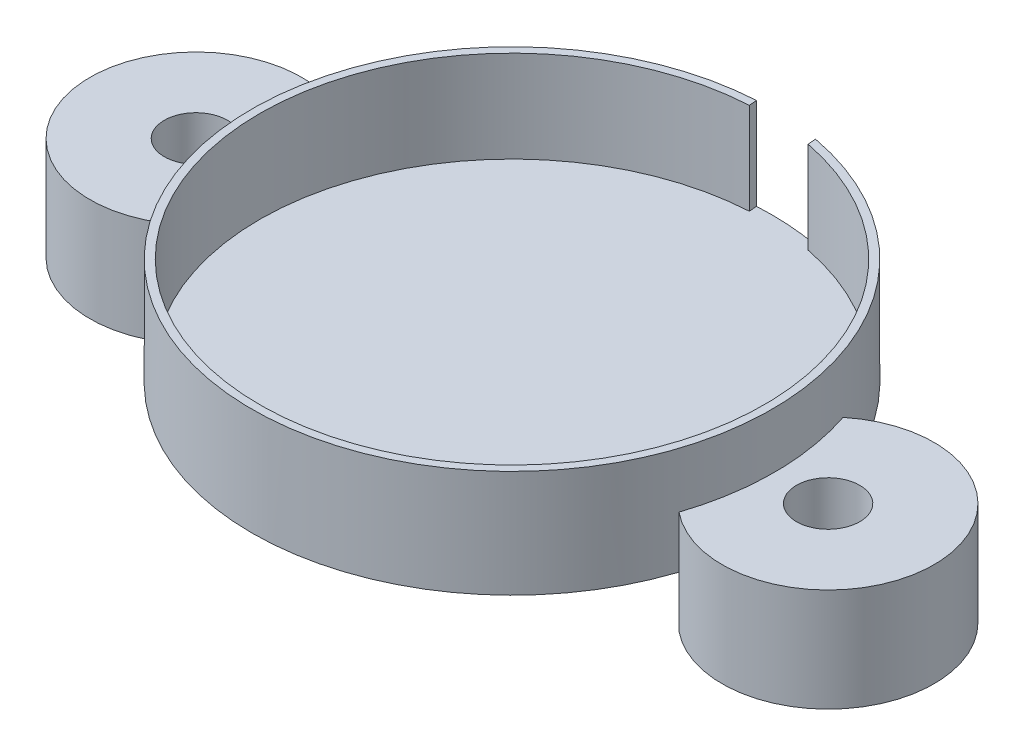
ISO-10303-21;
HEADER;
FILE_DESCRIPTION(('STEP AP214'),'2;1');
FILE_NAME('part.step','',(''),(''),'','','');
FILE_SCHEMA(('AUTOMOTIVE_DESIGN { 1 0 10303 214 1 1 1 1 }'));
ENDSEC;
DATA;
#1=APPLICATION_CONTEXT('core data for automotive mechanical design processes');
#2=APPLICATION_PROTOCOL_DEFINITION('international standard','automotive_design',2000,#1);
#3=PRODUCT_CONTEXT('',#1,'mechanical');
#4=PRODUCT('Part','Part','',(#3));
#5=PRODUCT_RELATED_PRODUCT_CATEGORY('part','',(#4));
#6=PRODUCT_DEFINITION_FORMATION('','',#4);
#7=PRODUCT_DEFINITION_CONTEXT('part definition',#1,'design');
#8=PRODUCT_DEFINITION('design','',#6,#7);
#9=PRODUCT_DEFINITION_SHAPE('','',#8);
#10=(LENGTH_UNIT() NAMED_UNIT(*) SI_UNIT(.MILLI.,.METRE.));
#11=(NAMED_UNIT(*) PLANE_ANGLE_UNIT() SI_UNIT($,.RADIAN.));
#12=(NAMED_UNIT(*) SI_UNIT($,.STERADIAN.) SOLID_ANGLE_UNIT());
#13=UNCERTAINTY_MEASURE_WITH_UNIT(LENGTH_MEASURE(1.E-05),#10,'distance_accuracy_value','');
#14=(GEOMETRIC_REPRESENTATION_CONTEXT(3) GLOBAL_UNCERTAINTY_ASSIGNED_CONTEXT((#13)) GLOBAL_UNIT_ASSIGNED_CONTEXT((#10,
#11,#12)) REPRESENTATION_CONTEXT('',''));
#15=CARTESIAN_POINT('',(0.,0.,0.));
#16=DIRECTION('',(0.,0.,1.));
#17=DIRECTION('',(1.,0.,0.));
#18=AXIS2_PLACEMENT_3D('',#15,#16,#17);
#19=CARTESIAN_POINT('',(-32.6182191368439,-10.16,0.));
#20=DIRECTION('',(0.,1.,0.));
#21=DIRECTION('',(0.,0.,1.));
#22=AXIS2_PLACEMENT_3D('',#19,#20,#21);
#23=PLANE('',#22);
#24=CARTESIAN_POINT('',(-0.46643827368778,-10.16,0.));
#25=DIRECTION('',(0.,1.,0.));
#26=DIRECTION('',(0.,0.,1.));
#27=AXIS2_PLACEMENT_3D('',#24,#25,#26);
#28=CIRCLE('',#27,53.276500000001);
#29=CARTESIAN_POINT('',(-51.0212227941176,-10.16,-16.8106875035797));
#30=VERTEX_POINT('',#29);
#31=CARTESIAN_POINT('',(-51.0212227941177,-10.16,16.8106875035797));
#32=VERTEX_POINT('',#31);
#33=EDGE_CURVE('E89',#30,#32,#28,.T.);
#34=ORIENTED_EDGE('',*,*,#33,.T.);
#35=CARTESIAN_POINT('',(-64.77,-10.16,0.));
#36=DIRECTION('',(0.,-1.,0.));
#37=DIRECTION('',(0.,0.,-1.));
#38=AXIS2_PLACEMENT_3D('',#35,#36,#37);
#39=CIRCLE('',#38,21.717);
#40=EDGE_CURVE('E64',#32,#30,#39,.T.);
#41=ORIENTED_EDGE('',*,*,#40,.T.);
#42=EDGE_LOOP('',(#34,#41));
#43=FACE_BOUND('',#42,.T.);
#44=CARTESIAN_POINT('',(-64.77,-10.16,0.));
#45=DIRECTION('',(0.,-1.,0.));
#46=DIRECTION('',(0.,0.,-1.));
#47=AXIS2_PLACEMENT_3D('',#44,#45,#46);
#48=CIRCLE('',#47,6.477);
#49=CARTESIAN_POINT('',(-64.77,-10.16,-6.477));
#50=VERTEX_POINT('',#49);
#51=EDGE_CURVE('E86',#50,#50,#48,.T.);
#52=ORIENTED_EDGE('',*,*,#51,.F.);
#53=EDGE_LOOP('',(#52));
#54=FACE_BOUND('',#53,.T.);
#55=ADVANCED_FACE('F50',(#43,#54),#23,.F.);
#56=CARTESIAN_POINT('',(-0.46643827368778,-10.16,0.));
#57=DIRECTION('',(0.,1.,0.));
#58=DIRECTION('',(0.,0.,1.));
#59=AXIS2_PLACEMENT_3D('',#56,#57,#58);
#60=CYLINDRICAL_SURFACE('',#59,53.276500000001);
#61=DIRECTION('',(0.,1.,0.));
#62=VECTOR('',#61,1.);
#63=CARTESIAN_POINT('',(-51.0212227941176,-10.16,-16.8106875035797));
#64=LINE('',#63,#62);
#65=CARTESIAN_POINT('',(-51.0212227941176,10.9855,-16.8106875035797));
#66=VERTEX_POINT('',#65);
#67=EDGE_CURVE('E58',#30,#66,#64,.T.);
#68=ORIENTED_EDGE('',*,*,#67,.T.);
#69=CARTESIAN_POINT('',(-0.46643827368778,10.9855,0.));
#70=DIRECTION('',(0.,1.,0.));
#71=DIRECTION('',(0.,0.,1.));
#72=AXIS2_PLACEMENT_3D('',#69,#70,#71);
#73=CIRCLE('',#72,53.276500000001);
#74=CARTESIAN_POINT('',(-51.0212227941177,10.9855,16.8106875035797));
#75=VERTEX_POINT('',#74);
#76=EDGE_CURVE('E81',#66,#75,#73,.T.);
#77=ORIENTED_EDGE('',*,*,#76,.T.);
#78=DIRECTION('',(0.,1.,0.));
#79=VECTOR('',#78,1.);
#80=CARTESIAN_POINT('',(-51.0212227941177,-10.16,16.8106875035797));
#81=LINE('',#80,#79);
#82=EDGE_CURVE('E12',#32,#75,#81,.T.);
#83=ORIENTED_EDGE('',*,*,#82,.F.);
#84=ORIENTED_EDGE('',*,*,#33,.F.);
#85=EDGE_LOOP('',(#68,#77,#83,#84));
#86=FACE_BOUND('',#85,.T.);
#87=ADVANCED_FACE('F52',(#86),#60,.F.);
#88=CARTESIAN_POINT('',(-64.77,-10.16,0.));
#89=DIRECTION('',(0.,1.,0.));
#90=DIRECTION('',(0.,0.,1.));
#91=AXIS2_PLACEMENT_3D('',#88,#89,#90);
#92=CYLINDRICAL_SURFACE('',#91,21.717);
#93=ORIENTED_EDGE('',*,*,#82,.T.);
#94=CARTESIAN_POINT('',(-64.77,10.9855,0.));
#95=DIRECTION('',(0.,-1.,0.));
#96=DIRECTION('',(0.,0.,-1.));
#97=AXIS2_PLACEMENT_3D('',#94,#95,#96);
#98=CIRCLE('',#97,21.717);
#99=EDGE_CURVE('E77',#75,#66,#98,.T.);
#100=ORIENTED_EDGE('',*,*,#99,.T.);
#101=ORIENTED_EDGE('',*,*,#67,.F.);
#102=ORIENTED_EDGE('',*,*,#40,.F.);
#103=EDGE_LOOP('',(#93,#100,#101,#102));
#104=FACE_BOUND('',#103,.T.);
#105=ADVANCED_FACE('F75',(#104),#92,.T.);
#106=CARTESIAN_POINT('',(-64.77,-10.16,0.));
#107=DIRECTION('',(0.,1.,0.));
#108=DIRECTION('',(0.,0.,1.));
#109=AXIS2_PLACEMENT_3D('',#106,#107,#108);
#110=CYLINDRICAL_SURFACE('',#109,6.477);
#111=ORIENTED_EDGE('',*,*,#51,.T.);
#112=EDGE_LOOP('',(#111));
#113=FACE_BOUND('',#112,.T.);
#114=CARTESIAN_POINT('',(-64.77,10.9855,0.));
#115=DIRECTION('',(0.,-1.,0.));
#116=DIRECTION('',(0.,0.,-1.));
#117=AXIS2_PLACEMENT_3D('',#114,#115,#116);
#118=CIRCLE('',#117,6.477);
#119=CARTESIAN_POINT('',(-64.77,10.9855,-6.477));
#120=VERTEX_POINT('',#119);
#121=EDGE_CURVE('E83',#120,#120,#118,.T.);
#122=ORIENTED_EDGE('',*,*,#121,.F.);
#123=EDGE_LOOP('',(#122));
#124=FACE_BOUND('',#123,.T.);
#125=ADVANCED_FACE('F99',(#113,#124),#110,.F.);
#126=CARTESIAN_POINT('',(-32.6182191368439,10.9855,0.));
#127=DIRECTION('',(0.,1.,0.));
#128=DIRECTION('',(0.,0.,1.));
#129=AXIS2_PLACEMENT_3D('',#126,#127,#128);
#130=PLANE('',#129);
#131=ORIENTED_EDGE('',*,*,#121,.T.);
#132=EDGE_LOOP('',(#131));
#133=FACE_BOUND('',#132,.T.);
#134=ORIENTED_EDGE('',*,*,#76,.F.);
#135=ORIENTED_EDGE('',*,*,#99,.F.);
#136=EDGE_LOOP('',(#134,#135));
#137=FACE_BOUND('',#136,.T.);
#138=ADVANCED_FACE('F85',(#133,#137),#130,.T.);
#139=CLOSED_SHELL('',(#55,#87,#105,#125,#138));
#140=MANIFOLD_SOLID_BREP('B2',#139);
#141=CARTESIAN_POINT('',(32.6182191368444,-10.16,0.));
#142=DIRECTION('',(0.,1.,0.));
#143=DIRECTION('',(0.,0.,1.));
#144=AXIS2_PLACEMENT_3D('',#141,#142,#143);
#145=PLANE('',#144);
#146=CARTESIAN_POINT('',(0.466438273688814,-10.16,0.));
#147=DIRECTION('',(0.,1.,0.));
#148=DIRECTION('',(0.,0.,1.));
#149=AXIS2_PLACEMENT_3D('',#146,#147,#148);
#150=CIRCLE('',#149,53.2765);
#151=CARTESIAN_POINT('',(51.0212227941176,-10.16,16.8106875035797));
#152=VERTEX_POINT('',#151);
#153=CARTESIAN_POINT('',(51.0212227941176,-10.16,-16.8106875035797));
#154=VERTEX_POINT('',#153);
#155=EDGE_CURVE('E197',#152,#154,#150,.T.);
#156=ORIENTED_EDGE('',*,*,#155,.T.);
#157=CARTESIAN_POINT('',(64.77,-10.16,0.));
#158=DIRECTION('',(0.,-1.,0.));
#159=DIRECTION('',(0.,0.,-1.));
#160=AXIS2_PLACEMENT_3D('',#157,#158,#159);
#161=CIRCLE('',#160,21.717);
#162=EDGE_CURVE('E172',#154,#152,#161,.T.);
#163=ORIENTED_EDGE('',*,*,#162,.T.);
#164=EDGE_LOOP('',(#156,#163));
#165=FACE_BOUND('',#164,.T.);
#166=CARTESIAN_POINT('',(64.77,-10.16,0.));
#167=DIRECTION('',(0.,-1.,0.));
#168=DIRECTION('',(0.,0.,-1.));
#169=AXIS2_PLACEMENT_3D('',#166,#167,#168);
#170=CIRCLE('',#169,6.477);
#171=CARTESIAN_POINT('',(64.77,-10.16,-6.477));
#172=VERTEX_POINT('',#171);
#173=EDGE_CURVE('E194',#172,#172,#170,.T.);
#174=ORIENTED_EDGE('',*,*,#173,.F.);
#175=EDGE_LOOP('',(#174));
#176=FACE_BOUND('',#175,.T.);
#177=ADVANCED_FACE('F158',(#165,#176),#145,.F.);
#178=CARTESIAN_POINT('',(0.466438273688814,-10.16,0.));
#179=DIRECTION('',(0.,1.,0.));
#180=DIRECTION('',(0.,0.,1.));
#181=AXIS2_PLACEMENT_3D('',#178,#179,#180);
#182=CYLINDRICAL_SURFACE('',#181,53.2765);
#183=DIRECTION('',(0.,1.,0.));
#184=VECTOR('',#183,1.);
#185=CARTESIAN_POINT('',(51.0212227941176,-10.16,16.8106875035797));
#186=LINE('',#185,#184);
#187=CARTESIAN_POINT('',(51.0212227941176,10.9855,16.8106875035797));
#188=VERTEX_POINT('',#187);
#189=EDGE_CURVE('E166',#152,#188,#186,.T.);
#190=ORIENTED_EDGE('',*,*,#189,.T.);
#191=CARTESIAN_POINT('',(0.466438273688814,10.9855,0.));
#192=DIRECTION('',(0.,1.,0.));
#193=DIRECTION('',(0.,0.,1.));
#194=AXIS2_PLACEMENT_3D('',#191,#192,#193);
#195=CIRCLE('',#194,53.2765);
#196=CARTESIAN_POINT('',(51.0212227941176,10.9855,-16.8106875035797));
#197=VERTEX_POINT('',#196);
#198=EDGE_CURVE('E189',#188,#197,#195,.T.);
#199=ORIENTED_EDGE('',*,*,#198,.T.);
#200=DIRECTION('',(0.,1.,0.));
#201=VECTOR('',#200,1.);
#202=CARTESIAN_POINT('',(51.0212227941176,-10.16,-16.8106875035797));
#203=LINE('',#202,#201);
#204=EDGE_CURVE('E48',#154,#197,#203,.T.);
#205=ORIENTED_EDGE('',*,*,#204,.F.);
#206=ORIENTED_EDGE('',*,*,#155,.F.);
#207=EDGE_LOOP('',(#190,#199,#205,#206));
#208=FACE_BOUND('',#207,.T.);
#209=ADVANCED_FACE('F160',(#208),#182,.F.);
#210=CARTESIAN_POINT('',(64.77,-10.16,0.));
#211=DIRECTION('',(0.,1.,0.));
#212=DIRECTION('',(0.,0.,1.));
#213=AXIS2_PLACEMENT_3D('',#210,#211,#212);
#214=CYLINDRICAL_SURFACE('',#213,21.717);
#215=ORIENTED_EDGE('',*,*,#204,.T.);
#216=CARTESIAN_POINT('',(64.77,10.9855,0.));
#217=DIRECTION('',(0.,-1.,0.));
#218=DIRECTION('',(0.,0.,-1.));
#219=AXIS2_PLACEMENT_3D('',#216,#217,#218);
#220=CIRCLE('',#219,21.717);
#221=EDGE_CURVE('E185',#197,#188,#220,.T.);
#222=ORIENTED_EDGE('',*,*,#221,.T.);
#223=ORIENTED_EDGE('',*,*,#189,.F.);
#224=ORIENTED_EDGE('',*,*,#162,.F.);
#225=EDGE_LOOP('',(#215,#222,#223,#224));
#226=FACE_BOUND('',#225,.T.);
#227=ADVANCED_FACE('F183',(#226),#214,.T.);
#228=CARTESIAN_POINT('',(64.77,-10.16,0.));
#229=DIRECTION('',(0.,1.,0.));
#230=DIRECTION('',(0.,0.,1.));
#231=AXIS2_PLACEMENT_3D('',#228,#229,#230);
#232=CYLINDRICAL_SURFACE('',#231,6.477);
#233=ORIENTED_EDGE('',*,*,#173,.T.);
#234=EDGE_LOOP('',(#233));
#235=FACE_BOUND('',#234,.T.);
#236=CARTESIAN_POINT('',(64.77,10.9855,0.));
#237=DIRECTION('',(0.,-1.,0.));
#238=DIRECTION('',(0.,0.,-1.));
#239=AXIS2_PLACEMENT_3D('',#236,#237,#238);
#240=CIRCLE('',#239,6.477);
#241=CARTESIAN_POINT('',(64.77,10.9855,-6.477));
#242=VERTEX_POINT('',#241);
#243=EDGE_CURVE('E191',#242,#242,#240,.T.);
#244=ORIENTED_EDGE('',*,*,#243,.F.);
#245=EDGE_LOOP('',(#244));
#246=FACE_BOUND('',#245,.T.);
#247=ADVANCED_FACE('F207',(#235,#246),#232,.F.);
#248=CARTESIAN_POINT('',(32.6182191368444,10.9855,0.));
#249=DIRECTION('',(0.,1.,0.));
#250=DIRECTION('',(0.,0.,1.));
#251=AXIS2_PLACEMENT_3D('',#248,#249,#250);
#252=PLANE('',#251);
#253=ORIENTED_EDGE('',*,*,#243,.T.);
#254=EDGE_LOOP('',(#253));
#255=FACE_BOUND('',#254,.T.);
#256=ORIENTED_EDGE('',*,*,#198,.F.);
#257=ORIENTED_EDGE('',*,*,#221,.F.);
#258=EDGE_LOOP('',(#256,#257));
#259=FACE_BOUND('',#258,.T.);
#260=ADVANCED_FACE('F193',(#255,#259),#252,.T.);
#261=CLOSED_SHELL('',(#177,#209,#227,#247,#260));
#262=MANIFOLD_SOLID_BREP('B6',#261);
#263=CARTESIAN_POINT('',(0.,21.971,0.));
#264=DIRECTION('',(0.,-1.,0.));
#265=DIRECTION('',(0.,0.,-1.));
#266=AXIS2_PLACEMENT_3D('',#263,#264,#265);
#267=CYLINDRICAL_SURFACE('',#266,53.2892);
#268=CARTESIAN_POINT('',(0.,3.175,0.));
#269=DIRECTION('',(0.,1.,0.));
#270=DIRECTION('',(0.,0.,1.));
#271=AXIS2_PLACEMENT_3D('',#268,#269,#270);
#272=CIRCLE('',#271,53.2892);
#273=CARTESIAN_POINT('',(9.79185200751959,3.175,-52.3818524959058));
#274=VERTEX_POINT('',#273);
#275=CARTESIAN_POINT('',(-3.10443322938926,3.175,-53.1986967036248));
#276=VERTEX_POINT('',#275);
#277=EDGE_CURVE('E302',#274,#276,#272,.T.);
#278=ORIENTED_EDGE('',*,*,#277,.F.);
#279=DIRECTION('',(0.,1.,0.));
#280=VECTOR('',#279,1.);
#281=CARTESIAN_POINT('',(9.79185200751959,3.175,-52.3818524959058));
#282=LINE('',#281,#280);
#283=CARTESIAN_POINT('',(9.79185200751959,21.971,-52.3818524959058));
#284=VERTEX_POINT('',#283);
#285=EDGE_CURVE('E275',#274,#284,#282,.T.);
#286=ORIENTED_EDGE('',*,*,#285,.T.);
#287=CARTESIAN_POINT('',(0.,21.971,0.));
#288=DIRECTION('',(0.,1.,0.));
#289=DIRECTION('',(0.,0.,1.));
#290=AXIS2_PLACEMENT_3D('',#287,#288,#289);
#291=CIRCLE('',#290,53.2892);
#292=CARTESIAN_POINT('',(-3.10443322938926,21.971,-53.1986967036248));
#293=VERTEX_POINT('',#292);
#294=EDGE_CURVE('E156',#293,#284,#291,.T.);
#295=ORIENTED_EDGE('',*,*,#294,.F.);
#296=DIRECTION('',(0.,1.,0.));
#297=VECTOR('',#296,1.);
#298=CARTESIAN_POINT('',(-3.10443322938926,3.175,-53.1986967036248));
#299=LINE('',#298,#297);
#300=EDGE_CURVE('E295',#276,#293,#299,.T.);
#301=ORIENTED_EDGE('',*,*,#300,.F.);
#302=EDGE_LOOP('',(#278,#286,#295,#301));
#303=FACE_BOUND('',#302,.T.);
#304=CARTESIAN_POINT('',(0.,0.,0.));
#305=DIRECTION('',(0.,1.,0.));
#306=DIRECTION('',(0.,0.,1.));
#307=AXIS2_PLACEMENT_3D('',#304,#305,#306);
#308=CIRCLE('',#307,53.2892);
#309=CARTESIAN_POINT('',(0.,0.,53.2892));
#310=VERTEX_POINT('',#309);
#311=EDGE_CURVE('E254',#310,#310,#308,.T.);
#312=ORIENTED_EDGE('',*,*,#311,.T.);
#313=EDGE_LOOP('',(#312));
#314=FACE_BOUND('',#313,.T.);
#315=ADVANCED_FACE('F251',(#303,#314),#267,.T.);
#316=CARTESIAN_POINT('',(0.,21.971,0.));
#317=DIRECTION('',(0.,1.,0.));
#318=DIRECTION('',(0.,0.,1.));
#319=AXIS2_PLACEMENT_3D('',#316,#317,#318);
#320=PLANE('',#319);
#321=DIRECTION('',(-0.0977422138324264,0.,-0.995211766226232));
#322=VECTOR('',#321,1.);
#323=CARTESIAN_POINT('',(9.9549373670461,21.971,-50.7213164558866));
#324=LINE('',#323,#322);
#325=CARTESIAN_POINT('',(9.9549373670461,21.971,-50.7213164558866));
#326=VERTEX_POINT('',#325);
#327=EDGE_CURVE('E291',#326,#284,#324,.T.);
#328=ORIENTED_EDGE('',*,*,#327,.F.);
#329=CARTESIAN_POINT('',(0.,21.971,0.));
#330=DIRECTION('',(0.,1.,0.));
#331=DIRECTION('',(0.,0.,1.));
#332=AXIS2_PLACEMENT_3D('',#329,#330,#331);
#333=CIRCLE('',#332,51.689);
#334=CARTESIAN_POINT('',(-2.96897779143562,21.971,-51.603661613048));
#335=VERTEX_POINT('',#334);
#336=EDGE_CURVE('E323',#335,#326,#333,.T.);
#337=ORIENTED_EDGE('',*,*,#336,.F.);
#338=DIRECTION('',(0.0846185870057846,0.,0.996413415572645));
#339=VECTOR('',#338,1.);
#340=CARTESIAN_POINT('',(-2.96897779143563,21.971,-51.603661613048));
#341=LINE('',#340,#339);
#342=EDGE_CURVE('E335',#293,#335,#341,.T.);
#343=ORIENTED_EDGE('',*,*,#342,.F.);
#344=ORIENTED_EDGE('',*,*,#294,.T.);
#345=EDGE_LOOP('',(#328,#337,#343,#344));
#346=FACE_BOUND('',#345,.T.);
#347=ADVANCED_FACE('F339',(#346),#320,.T.);
#348=CARTESIAN_POINT('',(0.,0.,0.));
#349=DIRECTION('',(0.,1.,0.));
#350=DIRECTION('',(0.,0.,1.));
#351=AXIS2_PLACEMENT_3D('',#348,#349,#350);
#352=PLANE('',#351);
#353=ORIENTED_EDGE('',*,*,#311,.F.);
#354=EDGE_LOOP('',(#353));
#355=FACE_BOUND('',#354,.T.);
#356=ADVANCED_FACE('F341',(#355),#352,.F.);
#357=CARTESIAN_POINT('',(0.,3.175,0.));
#358=DIRECTION('',(0.,1.,0.));
#359=DIRECTION('',(0.,0.,1.));
#360=AXIS2_PLACEMENT_3D('',#357,#358,#359);
#361=CYLINDRICAL_SURFACE('',#360,51.689);
#362=ORIENTED_EDGE('',*,*,#336,.T.);
#363=DIRECTION('',(0.,1.,0.));
#364=VECTOR('',#363,1.);
#365=CARTESIAN_POINT('',(9.9549373670461,3.175,-50.7213164558866));
#366=LINE('',#365,#364);
#367=CARTESIAN_POINT('',(9.9549373670461,3.175,-50.7213164558866));
#368=VERTEX_POINT('',#367);
#369=EDGE_CURVE('E315',#368,#326,#366,.T.);
#370=ORIENTED_EDGE('',*,*,#369,.F.);
#371=CARTESIAN_POINT('',(0.,3.175,0.));
#372=DIRECTION('',(0.,1.,0.));
#373=DIRECTION('',(0.,0.,1.));
#374=AXIS2_PLACEMENT_3D('',#371,#372,#373);
#375=CIRCLE('',#374,51.689);
#376=CARTESIAN_POINT('',(-2.96897779143563,3.175,-51.603661613048));
#377=VERTEX_POINT('',#376);
#378=EDGE_CURVE('E320',#377,#368,#375,.T.);
#379=ORIENTED_EDGE('',*,*,#378,.F.);
#380=DIRECTION('',(0.,1.,0.));
#381=VECTOR('',#380,1.);
#382=CARTESIAN_POINT('',(-2.96897779143562,3.175,-51.603661613048));
#383=LINE('',#382,#381);
#384=EDGE_CURVE('E298',#377,#335,#383,.T.);
#385=ORIENTED_EDGE('',*,*,#384,.T.);
#386=EDGE_LOOP('',(#362,#370,#379,#385));
#387=FACE_BOUND('',#386,.T.);
#388=ADVANCED_FACE('F338',(#387),#361,.F.);
#389=CARTESIAN_POINT('',(0.,3.175,0.));
#390=DIRECTION('',(0.,1.,0.));
#391=DIRECTION('',(0.,0.,1.));
#392=AXIS2_PLACEMENT_3D('',#389,#390,#391);
#393=PLANE('',#392);
#394=ORIENTED_EDGE('',*,*,#378,.T.);
#395=DIRECTION('',(-0.0977422138324264,0.,-0.995211766226232));
#396=VECTOR('',#395,1.);
#397=CARTESIAN_POINT('',(9.9549373670461,3.175,-50.7213164558866));
#398=LINE('',#397,#396);
#399=EDGE_CURVE('E301',#368,#274,#398,.T.);
#400=ORIENTED_EDGE('',*,*,#399,.T.);
#401=ORIENTED_EDGE('',*,*,#277,.T.);
#402=DIRECTION('',(0.0846185870057846,0.,0.996413415572645));
#403=VECTOR('',#402,1.);
#404=CARTESIAN_POINT('',(-2.96897779143563,3.175,-51.603661613048));
#405=LINE('',#404,#403);
#406=EDGE_CURVE('E266',#276,#377,#405,.T.);
#407=ORIENTED_EDGE('',*,*,#406,.T.);
#408=EDGE_LOOP('',(#394,#400,#401,#407));
#409=FACE_BOUND('',#408,.T.);
#410=ADVANCED_FACE('F305',(#409),#393,.T.);
#411=CARTESIAN_POINT('',(9.9549373670461,3.175,-50.7213164558866));
#412=DIRECTION('',(0.995211766226232,0.,-0.0977422138324265));
#413=DIRECTION('',(-0.0977422138324265,0.,-0.995211766226232));
#414=AXIS2_PLACEMENT_3D('',#411,#412,#413);
#415=PLANE('',#414);
#416=ORIENTED_EDGE('',*,*,#327,.T.);
#417=ORIENTED_EDGE('',*,*,#285,.F.);
#418=ORIENTED_EDGE('',*,*,#399,.F.);
#419=ORIENTED_EDGE('',*,*,#369,.T.);
#420=EDGE_LOOP('',(#416,#417,#418,#419));
#421=FACE_BOUND('',#420,.T.);
#422=ADVANCED_FACE('F353',(#421),#415,.F.);
#423=CARTESIAN_POINT('',(-2.96897779143563,3.175,-51.603661613048));
#424=DIRECTION('',(-0.996413415572645,0.,0.0846185870057846));
#425=DIRECTION('',(0.0846185870057846,0.,0.996413415572645));
#426=AXIS2_PLACEMENT_3D('',#423,#424,#425);
#427=PLANE('',#426);
#428=ORIENTED_EDGE('',*,*,#342,.T.);
#429=ORIENTED_EDGE('',*,*,#384,.F.);
#430=ORIENTED_EDGE('',*,*,#406,.F.);
#431=ORIENTED_EDGE('',*,*,#300,.T.);
#432=EDGE_LOOP('',(#428,#429,#430,#431));
#433=FACE_BOUND('',#432,.T.);
#434=ADVANCED_FACE('F293',(#433),#427,.F.);
#435=CLOSED_SHELL('',(#315,#347,#356,#388,#410,#422,#434));
#436=MANIFOLD_SOLID_BREP('B42',#435);
#437=ADVANCED_BREP_SHAPE_REPRESENTATION('',(#18,#140,#262,#436),#14);
#438=SHAPE_DEFINITION_REPRESENTATION(#9,#437);
ENDSEC;
END-ISO-10303-21;
